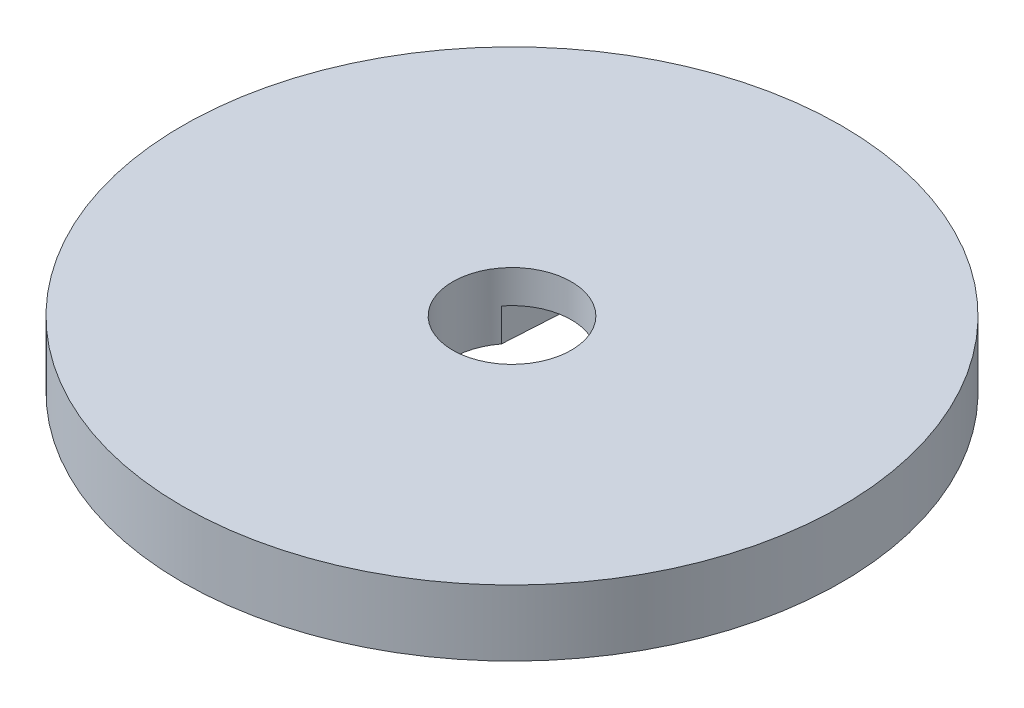
ISO-10303-21;
HEADER;
FILE_DESCRIPTION(('STEP AP214'),'2;1');
FILE_NAME('part.step','',(''),(''),'','','');
FILE_SCHEMA(('AUTOMOTIVE_DESIGN { 1 0 10303 214 1 1 1 1 }'));
ENDSEC;
DATA;
#1=APPLICATION_CONTEXT('core data for automotive mechanical design processes');
#2=APPLICATION_PROTOCOL_DEFINITION('international standard','automotive_design',2000,#1);
#3=PRODUCT_CONTEXT('',#1,'mechanical');
#4=PRODUCT('Part','Part','',(#3));
#5=PRODUCT_RELATED_PRODUCT_CATEGORY('part','',(#4));
#6=PRODUCT_DEFINITION_FORMATION('','',#4);
#7=PRODUCT_DEFINITION_CONTEXT('part definition',#1,'design');
#8=PRODUCT_DEFINITION('design','',#6,#7);
#9=PRODUCT_DEFINITION_SHAPE('','',#8);
#10=(LENGTH_UNIT() NAMED_UNIT(*) SI_UNIT(.MILLI.,.METRE.));
#11=(NAMED_UNIT(*) PLANE_ANGLE_UNIT() SI_UNIT($,.RADIAN.));
#12=(NAMED_UNIT(*) SI_UNIT($,.STERADIAN.) SOLID_ANGLE_UNIT());
#13=UNCERTAINTY_MEASURE_WITH_UNIT(LENGTH_MEASURE(1.E-05),#10,'distance_accuracy_value','');
#14=(GEOMETRIC_REPRESENTATION_CONTEXT(3) GLOBAL_UNCERTAINTY_ASSIGNED_CONTEXT((#13)) GLOBAL_UNIT_ASSIGNED_CONTEXT((#10,
#11,#12)) REPRESENTATION_CONTEXT('',''));
#15=CARTESIAN_POINT('',(0.,0.,0.));
#16=DIRECTION('',(0.,0.,1.));
#17=DIRECTION('',(1.,0.,0.));
#18=AXIS2_PLACEMENT_3D('',#15,#16,#17);
#19=CARTESIAN_POINT('',(0.,4.,0.));
#20=DIRECTION('',(0.,-1.,0.));
#21=DIRECTION('',(0.,0.,-1.));
#22=AXIS2_PLACEMENT_3D('',#19,#20,#21);
#23=CYLINDRICAL_SURFACE('',#22,3.6);
#24=CARTESIAN_POINT('',(0.,4.,0.));
#25=DIRECTION('',(0.,1.,0.));
#26=DIRECTION('',(0.,0.,1.));
#27=AXIS2_PLACEMENT_3D('',#24,#25,#26);
#28=CIRCLE('',#27,3.6);
#29=CARTESIAN_POINT('',(0.,4.,3.6));
#30=VERTEX_POINT('',#29);
#31=EDGE_CURVE('E48',#30,#30,#28,.T.);
#32=ORIENTED_EDGE('',*,*,#31,.T.);
#33=EDGE_LOOP('',(#32));
#34=FACE_BOUND('',#33,.T.);
#35=CARTESIAN_POINT('',(0.,2.,0.));
#36=DIRECTION('',(0.,1.,0.));
#37=DIRECTION('',(0.,0.,1.));
#38=AXIS2_PLACEMENT_3D('',#35,#36,#37);
#39=CIRCLE('',#38,3.6);
#40=CARTESIAN_POINT('',(-2.84799674125501,2.,2.2020251047163));
#41=VERTEX_POINT('',#40);
#42=CARTESIAN_POINT('',(2.84799674125501,2.,2.2020251047163));
#43=VERTEX_POINT('',#42);
#44=EDGE_CURVE('E127',#41,#43,#39,.T.);
#45=ORIENTED_EDGE('',*,*,#44,.F.);
#46=DIRECTION('',(0.,-1.,0.));
#47=VECTOR('',#46,1.);
#48=CARTESIAN_POINT('',(-2.84799674125501,2.,2.2020251047163));
#49=LINE('',#48,#47);
#50=CARTESIAN_POINT('',(-2.84799674125501,0.,2.2020251047163));
#51=VERTEX_POINT('',#50);
#52=EDGE_CURVE('E107',#41,#51,#49,.T.);
#53=ORIENTED_EDGE('',*,*,#52,.T.);
#54=CARTESIAN_POINT('',(0.,0.,0.));
#55=DIRECTION('',(0.,1.,0.));
#56=DIRECTION('',(0.,0.,1.));
#57=AXIS2_PLACEMENT_3D('',#54,#55,#56);
#58=CIRCLE('',#57,3.6);
#59=CARTESIAN_POINT('',(-2.84799674125501,0.,-2.20202510471631));
#60=VERTEX_POINT('',#59);
#61=EDGE_CURVE('E119',#60,#51,#58,.T.);
#62=ORIENTED_EDGE('',*,*,#61,.F.);
#63=DIRECTION('',(0.,-1.,0.));
#64=VECTOR('',#63,1.);
#65=CARTESIAN_POINT('',(-2.84799674125501,2.,-2.2020251047163));
#66=LINE('',#65,#64);
#67=CARTESIAN_POINT('',(-2.84799674125501,2.,-2.2020251047163));
#68=VERTEX_POINT('',#67);
#69=EDGE_CURVE('E56',#68,#60,#66,.T.);
#70=ORIENTED_EDGE('',*,*,#69,.F.);
#71=CARTESIAN_POINT('',(0.,2.,0.));
#72=DIRECTION('',(0.,1.,0.));
#73=DIRECTION('',(0.,0.,1.));
#74=AXIS2_PLACEMENT_3D('',#71,#72,#73);
#75=CIRCLE('',#74,3.6);
#76=CARTESIAN_POINT('',(2.84799674125501,2.,-2.2020251047163));
#77=VERTEX_POINT('',#76);
#78=EDGE_CURVE('E157',#77,#68,#75,.T.);
#79=ORIENTED_EDGE('',*,*,#78,.F.);
#80=DIRECTION('',(0.,-1.,0.));
#81=VECTOR('',#80,1.);
#82=CARTESIAN_POINT('',(2.84799674125501,2.,-2.2020251047163));
#83=LINE('',#82,#81);
#84=CARTESIAN_POINT('',(2.84799674125501,0.,-2.2020251047163));
#85=VERTEX_POINT('',#84);
#86=EDGE_CURVE('E146',#77,#85,#83,.T.);
#87=ORIENTED_EDGE('',*,*,#86,.T.);
#88=CARTESIAN_POINT('',(2.84799674125501,0.,2.2020251047163));
#89=VERTEX_POINT('',#88);
#90=EDGE_CURVE('E194',#89,#85,#58,.T.);
#91=ORIENTED_EDGE('',*,*,#90,.F.);
#92=DIRECTION('',(0.,-1.,0.));
#93=VECTOR('',#92,1.);
#94=CARTESIAN_POINT('',(2.84799674125501,2.,2.2020251047163));
#95=LINE('',#94,#93);
#96=EDGE_CURVE('E64',#43,#89,#95,.T.);
#97=ORIENTED_EDGE('',*,*,#96,.F.);
#98=EDGE_LOOP('',(#45,#53,#62,#70,#79,#87,#91,#97));
#99=FACE_BOUND('',#98,.T.);
#100=ADVANCED_FACE('F39',(#34,#99),#23,.F.);
#101=CARTESIAN_POINT('',(0.,0.,0.));
#102=DIRECTION('',(0.,1.,0.));
#103=DIRECTION('',(0.,0.,1.));
#104=AXIS2_PLACEMENT_3D('',#101,#102,#103);
#105=PLANE('',#104);
#106=CARTESIAN_POINT('',(0.,0.,0.));
#107=DIRECTION('',(0.,1.,0.));
#108=DIRECTION('',(0.,0.,1.));
#109=AXIS2_PLACEMENT_3D('',#106,#107,#108);
#110=CIRCLE('',#109,20.);
#111=CARTESIAN_POINT('',(0.,0.,20.));
#112=VERTEX_POINT('',#111);
#113=EDGE_CURVE('E42',#112,#112,#110,.T.);
#114=ORIENTED_EDGE('',*,*,#113,.F.);
#115=EDGE_LOOP('',(#114));
#116=FACE_BOUND('',#115,.T.);
#117=DIRECTION('',(0.0587830894018608,0.,0.998270779097722));
#118=VECTOR('',#117,1.);
#119=CARTESIAN_POINT('',(-2.96737363142246,0.,0.174733542358406));
#120=LINE('',#119,#118);
#121=CARTESIAN_POINT('',(-1.99999778081498,0.,16.6029793847024));
#122=VERTEX_POINT('',#121);
#123=EDGE_CURVE('E113',#51,#122,#120,.T.);
#124=ORIENTED_EDGE('',*,*,#123,.T.);
#125=CARTESIAN_POINT('',(0.,0.,16.6000000000004));
#126=DIRECTION('',(0.,1.,0.));
#127=DIRECTION('',(0.,0.,1.));
#128=AXIS2_PLACEMENT_3D('',#125,#126,#127);
#129=CIRCLE('',#128,1.99999999999951);
#130=CARTESIAN_POINT('',(1.99999778081498,0.,16.6029793847024));
#131=VERTEX_POINT('',#130);
#132=EDGE_CURVE('E136',#122,#131,#129,.T.);
#133=ORIENTED_EDGE('',*,*,#132,.T.);
#134=DIRECTION('',(0.0587830894018607,0.,-0.998270779097722));
#135=VECTOR('',#134,1.);
#136=CARTESIAN_POINT('',(2.96737363142246,0.,0.174733542358406));
#137=LINE('',#136,#135);
#138=EDGE_CURVE('E133',#131,#89,#137,.T.);
#139=ORIENTED_EDGE('',*,*,#138,.T.);
#140=ORIENTED_EDGE('',*,*,#90,.T.);
#141=DIRECTION('',(-0.0587830894018608,0.,-0.998270779097722));
#142=VECTOR('',#141,1.);
#143=CARTESIAN_POINT('',(2.96737363142246,0.,-0.174733542358406));
#144=LINE('',#143,#142);
#145=CARTESIAN_POINT('',(1.99999778081498,0.,-16.6029793847024));
#146=VERTEX_POINT('',#145);
#147=EDGE_CURVE('E171',#85,#146,#144,.T.);
#148=ORIENTED_EDGE('',*,*,#147,.T.);
#149=CARTESIAN_POINT('',(0.,0.,-16.6));
#150=DIRECTION('',(0.,1.,0.));
#151=DIRECTION('',(0.,0.,1.));
#152=AXIS2_PLACEMENT_3D('',#149,#150,#151);
#153=CIRCLE('',#152,1.99999999999951);
#154=CARTESIAN_POINT('',(-1.99999778081498,0.,-16.6029793847024));
#155=VERTEX_POINT('',#154);
#156=EDGE_CURVE('E175',#146,#155,#153,.T.);
#157=ORIENTED_EDGE('',*,*,#156,.T.);
#158=DIRECTION('',(-0.0587830894018606,0.,0.998270779097722));
#159=VECTOR('',#158,1.);
#160=CARTESIAN_POINT('',(-2.96737363142246,0.,-0.174733542358405));
#161=LINE('',#160,#159);
#162=EDGE_CURVE('E162',#155,#60,#161,.T.);
#163=ORIENTED_EDGE('',*,*,#162,.T.);
#164=ORIENTED_EDGE('',*,*,#61,.T.);
#165=EDGE_LOOP('',(#124,#133,#139,#140,#148,#157,#163,#164));
#166=FACE_BOUND('',#165,.T.);
#167=ADVANCED_FACE('F201',(#116,#166),#105,.F.);
#168=CARTESIAN_POINT('',(0.,4.,0.));
#169=DIRECTION('',(0.,-1.,0.));
#170=DIRECTION('',(0.,0.,-1.));
#171=AXIS2_PLACEMENT_3D('',#168,#169,#170);
#172=CYLINDRICAL_SURFACE('',#171,20.);
#173=CARTESIAN_POINT('',(0.,4.,0.));
#174=DIRECTION('',(0.,1.,0.));
#175=DIRECTION('',(0.,0.,1.));
#176=AXIS2_PLACEMENT_3D('',#173,#174,#175);
#177=CIRCLE('',#176,20.);
#178=CARTESIAN_POINT('',(0.,4.,20.));
#179=VERTEX_POINT('',#178);
#180=EDGE_CURVE('E11',#179,#179,#177,.T.);
#181=ORIENTED_EDGE('',*,*,#180,.F.);
#182=EDGE_LOOP('',(#181));
#183=FACE_BOUND('',#182,.T.);
#184=ORIENTED_EDGE('',*,*,#113,.T.);
#185=EDGE_LOOP('',(#184));
#186=FACE_BOUND('',#185,.T.);
#187=ADVANCED_FACE('F229',(#183,#186),#172,.T.);
#188=CARTESIAN_POINT('',(0.,4.,0.));
#189=DIRECTION('',(0.,1.,0.));
#190=DIRECTION('',(0.,0.,1.));
#191=AXIS2_PLACEMENT_3D('',#188,#189,#190);
#192=PLANE('',#191);
#193=ORIENTED_EDGE('',*,*,#31,.F.);
#194=EDGE_LOOP('',(#193));
#195=FACE_BOUND('',#194,.T.);
#196=ORIENTED_EDGE('',*,*,#180,.T.);
#197=EDGE_LOOP('',(#196));
#198=FACE_BOUND('',#197,.T.);
#199=ADVANCED_FACE('F234',(#195,#198),#192,.T.);
#200=CARTESIAN_POINT('',(2.96737363142246,2.,-0.174733542358406));
#201=DIRECTION('',(-0.998270779097722,0.,0.0587830894018608));
#202=DIRECTION('',(0.0587830894018608,0.,0.998270779097722));
#203=AXIS2_PLACEMENT_3D('',#200,#201,#202);
#204=PLANE('',#203);
#205=ORIENTED_EDGE('',*,*,#147,.F.);
#206=ORIENTED_EDGE('',*,*,#86,.F.);
#207=DIRECTION('',(-0.0587830894018608,0.,-0.998270779097722));
#208=VECTOR('',#207,1.);
#209=CARTESIAN_POINT('',(2.96737363142246,2.,-0.174733542358406));
#210=LINE('',#209,#208);
#211=CARTESIAN_POINT('',(1.99999778081498,2.,-16.6029793847024));
#212=VERTEX_POINT('',#211);
#213=EDGE_CURVE('E161',#77,#212,#210,.T.);
#214=ORIENTED_EDGE('',*,*,#213,.T.);
#215=DIRECTION('',(0.,-1.,0.));
#216=VECTOR('',#215,1.);
#217=CARTESIAN_POINT('',(1.99999778081498,2.,-16.6029793847024));
#218=LINE('',#217,#216);
#219=EDGE_CURVE('E186',#212,#146,#218,.T.);
#220=ORIENTED_EDGE('',*,*,#219,.T.);
#221=EDGE_LOOP('',(#205,#206,#214,#220));
#222=FACE_BOUND('',#221,.T.);
#223=ADVANCED_FACE('F210',(#222),#204,.T.);
#224=CARTESIAN_POINT('',(0.,2.,-16.6));
#225=DIRECTION('',(0.,-1.,0.));
#226=DIRECTION('',(0.,0.,-1.));
#227=AXIS2_PLACEMENT_3D('',#224,#225,#226);
#228=CYLINDRICAL_SURFACE('',#227,1.99999999999951);
#229=ORIENTED_EDGE('',*,*,#156,.F.);
#230=ORIENTED_EDGE('',*,*,#219,.F.);
#231=CARTESIAN_POINT('',(0.,2.,-16.6));
#232=DIRECTION('',(0.,1.,0.));
#233=DIRECTION('',(0.,0.,1.));
#234=AXIS2_PLACEMENT_3D('',#231,#232,#233);
#235=CIRCLE('',#234,1.99999999999951);
#236=CARTESIAN_POINT('',(-1.99999778081498,2.,-16.6029793847024));
#237=VERTEX_POINT('',#236);
#238=EDGE_CURVE('E165',#212,#237,#235,.T.);
#239=ORIENTED_EDGE('',*,*,#238,.T.);
#240=DIRECTION('',(0.,-1.,0.));
#241=VECTOR('',#240,1.);
#242=CARTESIAN_POINT('',(-1.99999778081498,2.,-16.6029793847024));
#243=LINE('',#242,#241);
#244=EDGE_CURVE('E183',#237,#155,#243,.T.);
#245=ORIENTED_EDGE('',*,*,#244,.T.);
#246=EDGE_LOOP('',(#229,#230,#239,#245));
#247=FACE_BOUND('',#246,.T.);
#248=ADVANCED_FACE('F213',(#247),#228,.F.);
#249=CARTESIAN_POINT('',(-2.96737363142246,2.,-0.174733542358405));
#250=DIRECTION('',(0.998270779097722,0.,0.0587830894018606));
#251=DIRECTION('',(0.0587830894018606,0.,-0.998270779097722));
#252=AXIS2_PLACEMENT_3D('',#249,#250,#251);
#253=PLANE('',#252);
#254=ORIENTED_EDGE('',*,*,#162,.F.);
#255=ORIENTED_EDGE('',*,*,#244,.F.);
#256=DIRECTION('',(-0.0587830894018606,0.,0.998270779097722));
#257=VECTOR('',#256,1.);
#258=CARTESIAN_POINT('',(-2.96737363142246,2.,-0.174733542358405));
#259=LINE('',#258,#257);
#260=EDGE_CURVE('E168',#237,#68,#259,.T.);
#261=ORIENTED_EDGE('',*,*,#260,.T.);
#262=ORIENTED_EDGE('',*,*,#69,.T.);
#263=EDGE_LOOP('',(#254,#255,#261,#262));
#264=FACE_BOUND('',#263,.T.);
#265=ADVANCED_FACE('F215',(#264),#253,.T.);
#266=CARTESIAN_POINT('',(0.,2.,0.));
#267=DIRECTION('',(0.,1.,0.));
#268=DIRECTION('',(0.,0.,1.));
#269=AXIS2_PLACEMENT_3D('',#266,#267,#268);
#270=PLANE('',#269);
#271=ORIENTED_EDGE('',*,*,#78,.T.);
#272=ORIENTED_EDGE('',*,*,#260,.F.);
#273=ORIENTED_EDGE('',*,*,#238,.F.);
#274=ORIENTED_EDGE('',*,*,#213,.F.);
#275=EDGE_LOOP('',(#271,#272,#273,#274));
#276=FACE_BOUND('',#275,.T.);
#277=ADVANCED_FACE('F206',(#276),#270,.F.);
#278=CARTESIAN_POINT('',(-2.96737363142246,2.,0.174733542358406));
#279=DIRECTION('',(0.998270779097722,0.,-0.0587830894018608));
#280=DIRECTION('',(-0.0587830894018608,0.,-0.998270779097722));
#281=AXIS2_PLACEMENT_3D('',#278,#279,#280);
#282=PLANE('',#281);
#283=ORIENTED_EDGE('',*,*,#123,.F.);
#284=ORIENTED_EDGE('',*,*,#52,.F.);
#285=DIRECTION('',(0.0587830894018608,0.,0.998270779097722));
#286=VECTOR('',#285,1.);
#287=CARTESIAN_POINT('',(-2.96737363142246,2.,0.174733542358406));
#288=LINE('',#287,#286);
#289=CARTESIAN_POINT('',(-1.99999778081498,2.,16.6029793847024));
#290=VERTEX_POINT('',#289);
#291=EDGE_CURVE('E110',#41,#290,#288,.T.);
#292=ORIENTED_EDGE('',*,*,#291,.T.);
#293=DIRECTION('',(0.,-1.,0.));
#294=VECTOR('',#293,1.);
#295=CARTESIAN_POINT('',(-1.99999778081498,2.,16.6029793847024));
#296=LINE('',#295,#294);
#297=EDGE_CURVE('E120',#290,#122,#296,.T.);
#298=ORIENTED_EDGE('',*,*,#297,.T.);
#299=EDGE_LOOP('',(#283,#284,#292,#298));
#300=FACE_BOUND('',#299,.T.);
#301=ADVANCED_FACE('F109',(#300),#282,.T.);
#302=CARTESIAN_POINT('',(0.,2.,16.6000000000004));
#303=DIRECTION('',(0.,-1.,0.));
#304=DIRECTION('',(0.,0.,-1.));
#305=AXIS2_PLACEMENT_3D('',#302,#303,#304);
#306=CYLINDRICAL_SURFACE('',#305,1.99999999999951);
#307=ORIENTED_EDGE('',*,*,#132,.F.);
#308=ORIENTED_EDGE('',*,*,#297,.F.);
#309=CARTESIAN_POINT('',(0.,2.,16.6000000000004));
#310=DIRECTION('',(0.,1.,0.));
#311=DIRECTION('',(0.,0.,1.));
#312=AXIS2_PLACEMENT_3D('',#309,#310,#311);
#313=CIRCLE('',#312,1.99999999999951);
#314=CARTESIAN_POINT('',(1.99999778081498,2.,16.6029793847024));
#315=VERTEX_POINT('',#314);
#316=EDGE_CURVE('E128',#290,#315,#313,.T.);
#317=ORIENTED_EDGE('',*,*,#316,.T.);
#318=DIRECTION('',(0.,-1.,0.));
#319=VECTOR('',#318,1.);
#320=CARTESIAN_POINT('',(1.99999778081498,2.,16.6029793847024));
#321=LINE('',#320,#319);
#322=EDGE_CURVE('E152',#315,#131,#321,.T.);
#323=ORIENTED_EDGE('',*,*,#322,.T.);
#324=EDGE_LOOP('',(#307,#308,#317,#323));
#325=FACE_BOUND('',#324,.T.);
#326=ADVANCED_FACE('F276',(#325),#306,.F.);
#327=CARTESIAN_POINT('',(2.96737363142246,2.,0.174733542358406));
#328=DIRECTION('',(-0.998270779097722,0.,-0.0587830894018607));
#329=DIRECTION('',(-0.0587830894018607,0.,0.998270779097722));
#330=AXIS2_PLACEMENT_3D('',#327,#328,#329);
#331=PLANE('',#330);
#332=ORIENTED_EDGE('',*,*,#138,.F.);
#333=ORIENTED_EDGE('',*,*,#322,.F.);
#334=DIRECTION('',(0.0587830894018607,0.,-0.998270779097722));
#335=VECTOR('',#334,1.);
#336=CARTESIAN_POINT('',(2.96737363142246,2.,0.174733542358406));
#337=LINE('',#336,#335);
#338=EDGE_CURVE('E141',#315,#43,#337,.T.);
#339=ORIENTED_EDGE('',*,*,#338,.T.);
#340=ORIENTED_EDGE('',*,*,#96,.T.);
#341=EDGE_LOOP('',(#332,#333,#339,#340));
#342=FACE_BOUND('',#341,.T.);
#343=ADVANCED_FACE('F285',(#342),#331,.T.);
#344=CARTESIAN_POINT('',(0.,2.,0.));
#345=DIRECTION('',(0.,1.,0.));
#346=DIRECTION('',(0.,0.,1.));
#347=AXIS2_PLACEMENT_3D('',#344,#345,#346);
#348=PLANE('',#347);
#349=ORIENTED_EDGE('',*,*,#44,.T.);
#350=ORIENTED_EDGE('',*,*,#338,.F.);
#351=ORIENTED_EDGE('',*,*,#316,.F.);
#352=ORIENTED_EDGE('',*,*,#291,.F.);
#353=EDGE_LOOP('',(#349,#350,#351,#352));
#354=FACE_BOUND('',#353,.T.);
#355=ADVANCED_FACE('F125',(#354),#348,.F.);
#356=CLOSED_SHELL('',(#100,#167,#187,#199,#223,#248,#265,#277,#301,#326,#343,#355));
#357=MANIFOLD_SOLID_BREP('B2',#356);
#358=ADVANCED_BREP_SHAPE_REPRESENTATION('',(#18,#357),#14);
#359=SHAPE_DEFINITION_REPRESENTATION(#9,#358);
ENDSEC;
END-ISO-10303-21;
